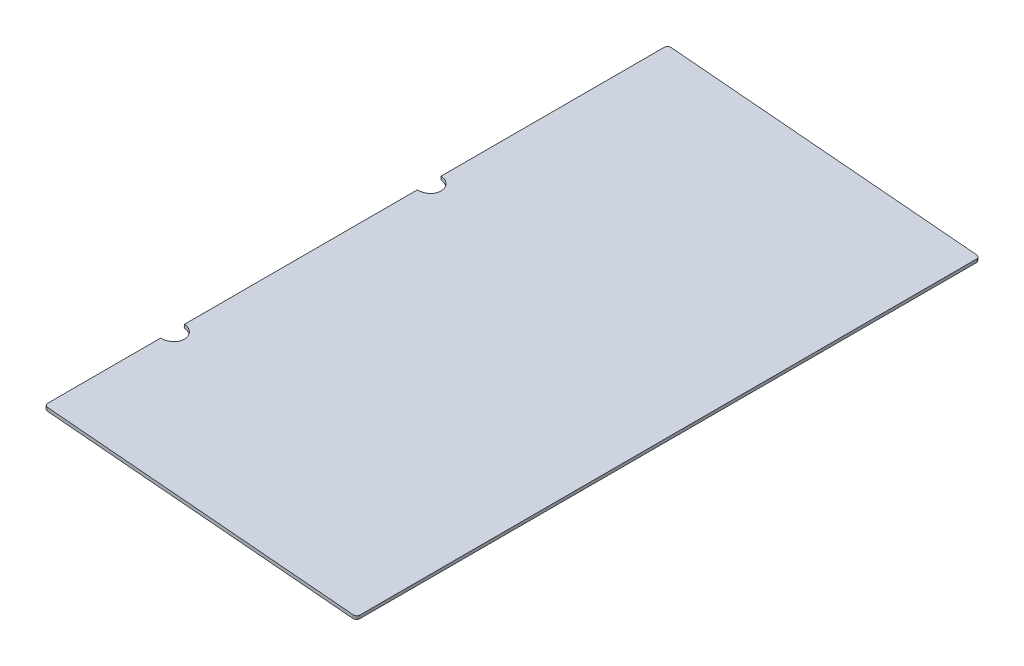
ISO-10303-21;
HEADER;
FILE_DESCRIPTION(('STEP AP214'),'2;1');
FILE_NAME('part.step','',(''),(''),'','','');
FILE_SCHEMA(('AUTOMOTIVE_DESIGN { 1 0 10303 214 1 1 1 1 }'));
ENDSEC;
DATA;
#1=APPLICATION_CONTEXT('core data for automotive mechanical design processes');
#2=APPLICATION_PROTOCOL_DEFINITION('international standard','automotive_design',2000,#1);
#3=PRODUCT_CONTEXT('',#1,'mechanical');
#4=PRODUCT('Part','Part','',(#3));
#5=PRODUCT_RELATED_PRODUCT_CATEGORY('part','',(#4));
#6=PRODUCT_DEFINITION_FORMATION('','',#4);
#7=PRODUCT_DEFINITION_CONTEXT('part definition',#1,'design');
#8=PRODUCT_DEFINITION('design','',#6,#7);
#9=PRODUCT_DEFINITION_SHAPE('','',#8);
#10=(LENGTH_UNIT() NAMED_UNIT(*) SI_UNIT(.MILLI.,.METRE.));
#11=(NAMED_UNIT(*) PLANE_ANGLE_UNIT() SI_UNIT($,.RADIAN.));
#12=(NAMED_UNIT(*) SI_UNIT($,.STERADIAN.) SOLID_ANGLE_UNIT());
#13=UNCERTAINTY_MEASURE_WITH_UNIT(LENGTH_MEASURE(1.E-05),#10,'distance_accuracy_value','');
#14=(GEOMETRIC_REPRESENTATION_CONTEXT(3) GLOBAL_UNCERTAINTY_ASSIGNED_CONTEXT((#13)) GLOBAL_UNIT_ASSIGNED_CONTEXT((#10,
#11,#12)) REPRESENTATION_CONTEXT('',''));
#15=CARTESIAN_POINT('',(0.,0.,0.));
#16=DIRECTION('',(0.,0.,1.));
#17=DIRECTION('',(1.,0.,0.));
#18=AXIS2_PLACEMENT_3D('',#15,#16,#17);
#19=CARTESIAN_POINT('',(22.7784389664476,57.5191558323467,1168.4));
#20=DIRECTION('',(0.996194698091745,-0.0871557427476619,0.));
#21=DIRECTION('',(0.0871557427476619,0.996194698091745,0.));
#22=AXIS2_PLACEMENT_3D('',#19,#20,#21);
#23=PLANE('',#22);
#24=DIRECTION('',(0.,0.,-1.));
#25=VECTOR('',#24,1.);
#26=CARTESIAN_POINT('',(22.7784389664476,57.5191558323467,1168.4));
#27=LINE('',#26,#25);
#28=CARTESIAN_POINT('',(22.7784389664476,57.5191558323467,424.65625));
#29=VERTEX_POINT('',#28);
#30=CARTESIAN_POINT('',(22.7784389664476,57.5191558323467,6.35000000000008));
#31=VERTEX_POINT('',#30);
#32=EDGE_CURVE('E156',#29,#31,#27,.T.);
#33=ORIENTED_EDGE('',*,*,#32,.T.);
#34=DIRECTION('',(-0.0871557427476619,-0.996194698091745,0.));
#35=VECTOR('',#34,1.);
#36=CARTESIAN_POINT('',(22.7784389664476,57.5191558323467,6.35000000000008));
#37=LINE('',#36,#35);
#38=CARTESIAN_POINT('',(22.225,51.1933194994641,6.35000000000008));
#39=VERTEX_POINT('',#38);
#40=EDGE_CURVE('E11',#31,#39,#37,.T.);
#41=ORIENTED_EDGE('',*,*,#40,.T.);
#42=DIRECTION('',(0.,0.,-1.));
#43=VECTOR('',#42,1.);
#44=CARTESIAN_POINT('',(22.225,51.1933194994641,1168.4));
#45=LINE('',#44,#43);
#46=CARTESIAN_POINT('',(22.225,51.1933194994641,424.65625));
#47=VERTEX_POINT('',#46);
#48=EDGE_CURVE('E170',#47,#39,#45,.T.);
#49=ORIENTED_EDGE('',*,*,#48,.F.);
#50=DIRECTION('',(0.0871557427476614,0.996194698091745,0.));
#51=VECTOR('',#50,1.);
#52=CARTESIAN_POINT('',(17.7801866800984,0.388870776980426,424.65625));
#53=LINE('',#52,#51);
#54=EDGE_CURVE('E225',#47,#29,#53,.T.);
#55=ORIENTED_EDGE('',*,*,#54,.T.);
#56=EDGE_LOOP('',(#33,#41,#49,#55));
#57=FACE_BOUND('',#56,.T.);
#58=ADVANCED_FACE('F38',(#57),#23,.F.);
#59=CARTESIAN_POINT('',(22.7784389664476,57.5191558323467,905.66875));
#60=VERTEX_POINT('',#59);
#61=CARTESIAN_POINT('',(22.7784389664476,57.5191558323467,469.10625));
#62=VERTEX_POINT('',#61);
#63=EDGE_CURVE('E146',#60,#62,#27,.T.);
#64=ORIENTED_EDGE('',*,*,#63,.T.);
#65=DIRECTION('',(0.0871557427476614,0.996194698091745,0.));
#66=VECTOR('',#65,1.);
#67=CARTESIAN_POINT('',(17.7801866800984,0.388870776980426,469.10625));
#68=LINE('',#67,#66);
#69=CARTESIAN_POINT('',(22.225,51.1933194994641,469.10625));
#70=VERTEX_POINT('',#69);
#71=EDGE_CURVE('E223',#62,#70,#68,.F.);
#72=ORIENTED_EDGE('',*,*,#71,.T.);
#73=CARTESIAN_POINT('',(22.225,51.1933194994641,905.66875));
#74=VERTEX_POINT('',#73);
#75=EDGE_CURVE('E148',#74,#70,#45,.T.);
#76=ORIENTED_EDGE('',*,*,#75,.F.);
#77=DIRECTION('',(0.0871557427476614,0.996194698091745,0.));
#78=VECTOR('',#77,1.);
#79=CARTESIAN_POINT('',(17.7801866800984,0.388870776980422,905.66875));
#80=LINE('',#79,#78);
#81=EDGE_CURVE('E132',#74,#60,#80,.T.);
#82=ORIENTED_EDGE('',*,*,#81,.T.);
#83=EDGE_LOOP('',(#64,#72,#76,#82));
#84=FACE_BOUND('',#83,.T.);
#85=ADVANCED_FACE('F144',(#84),#23,.F.);
#86=CARTESIAN_POINT('',(22.225,51.1933194994641,1162.05));
#87=VERTEX_POINT('',#86);
#88=CARTESIAN_POINT('',(22.225,51.1933194994641,950.11875));
#89=VERTEX_POINT('',#88);
#90=EDGE_CURVE('E171',#87,#89,#45,.T.);
#91=ORIENTED_EDGE('',*,*,#90,.F.);
#92=DIRECTION('',(-0.0871557427476619,-0.996194698091745,0.));
#93=VECTOR('',#92,1.);
#94=CARTESIAN_POINT('',(22.7784389664476,57.5191558323467,1162.05));
#95=LINE('',#94,#93);
#96=CARTESIAN_POINT('',(22.7784389664476,57.5191558323467,1162.05));
#97=VERTEX_POINT('',#96);
#98=EDGE_CURVE('E199',#87,#97,#95,.F.);
#99=ORIENTED_EDGE('',*,*,#98,.T.);
#100=CARTESIAN_POINT('',(22.7784389664476,57.5191558323467,950.11875));
#101=VERTEX_POINT('',#100);
#102=EDGE_CURVE('E155',#97,#101,#27,.T.);
#103=ORIENTED_EDGE('',*,*,#102,.T.);
#104=DIRECTION('',(0.0871557427476614,0.996194698091745,0.));
#105=VECTOR('',#104,1.);
#106=CARTESIAN_POINT('',(17.7801866800984,0.388870776980422,950.11875));
#107=LINE('',#106,#105);
#108=EDGE_CURVE('E135',#101,#89,#107,.F.);
#109=ORIENTED_EDGE('',*,*,#108,.T.);
#110=EDGE_LOOP('',(#91,#99,#103,#109));
#111=FACE_BOUND('',#110,.T.);
#112=ADVANCED_FACE('F250',(#111),#23,.F.);
#113=CARTESIAN_POINT('',(22.225,51.1933194994641,1168.4));
#114=DIRECTION('',(0.0871557427476615,0.996194698091745,0.));
#115=DIRECTION('',(-0.996194698091745,0.0871557427476615,0.));
#116=AXIS2_PLACEMENT_3D('',#113,#114,#115);
#117=PLANE('',#116);
#118=DIRECTION('',(0.,0.,-1.));
#119=VECTOR('',#118,1.);
#120=CARTESIAN_POINT('',(607.367319430825,0.,1168.4));
#121=LINE('',#120,#119);
#122=CARTESIAN_POINT('',(607.367319430825,0.,1162.05));
#123=VERTEX_POINT('',#122);
#124=CARTESIAN_POINT('',(607.367319430825,0.,6.35000000000008));
#125=VERTEX_POINT('',#124);
#126=EDGE_CURVE('E167',#123,#125,#121,.T.);
#127=ORIENTED_EDGE('',*,*,#126,.F.);
#128=CARTESIAN_POINT('',(601.041483097942,0.553438966447647,1162.05));
#129=DIRECTION('',(0.0871557427476615,0.996194698091745,0.));
#130=DIRECTION('',(-0.996194698091745,0.0871557427476615,0.));
#131=AXIS2_PLACEMENT_3D('',#128,#129,#130);
#132=CIRCLE('',#131,6.35);
#133=CARTESIAN_POINT('',(601.041483097942,0.553438966447634,1168.4));
#134=VERTEX_POINT('',#133);
#135=EDGE_CURVE('E197',#123,#134,#132,.F.);
#136=ORIENTED_EDGE('',*,*,#135,.T.);
#137=DIRECTION('',(0.996194698091745,-0.0871557427476615,0.));
#138=VECTOR('',#137,1.);
#139=CARTESIAN_POINT('',(22.225,51.1933194994641,1168.4));
#140=LINE('',#139,#138);
#141=CARTESIAN_POINT('',(28.5508363328826,50.6398805330165,1168.4));
#142=VERTEX_POINT('',#141);
#143=EDGE_CURVE('E208',#142,#134,#140,.T.);
#144=ORIENTED_EDGE('',*,*,#143,.F.);
#145=CARTESIAN_POINT('',(28.5508363328826,50.6398805330165,1162.05));
#146=DIRECTION('',(0.0871557427476615,0.996194698091745,0.));
#147=DIRECTION('',(-0.996194698091745,0.0871557427476615,0.));
#148=AXIS2_PLACEMENT_3D('',#145,#146,#147);
#149=CIRCLE('',#148,6.35);
#150=EDGE_CURVE('E53',#142,#87,#149,.F.);
#151=ORIENTED_EDGE('',*,*,#150,.T.);
#152=ORIENTED_EDGE('',*,*,#90,.T.);
#153=CARTESIAN_POINT('',(22.225,51.1933194994641,927.89375));
#154=DIRECTION('',(0.0871557427476615,0.996194698091745,0.));
#155=DIRECTION('',(-0.996194698091745,0.0871557427476615,0.));
#156=AXIS2_PLACEMENT_3D('',#153,#154,#155);
#157=CIRCLE('',#156,22.225);
#158=EDGE_CURVE('E217',#89,#74,#157,.T.);
#159=ORIENTED_EDGE('',*,*,#158,.T.);
#160=ORIENTED_EDGE('',*,*,#75,.T.);
#161=CARTESIAN_POINT('',(22.225,51.1933194994641,446.88125));
#162=DIRECTION('',(0.0871557427476615,0.996194698091745,0.));
#163=DIRECTION('',(-0.996194698091745,0.0871557427476615,0.));
#164=AXIS2_PLACEMENT_3D('',#161,#162,#163);
#165=CIRCLE('',#164,22.225);
#166=EDGE_CURVE('E149',#70,#47,#165,.T.);
#167=ORIENTED_EDGE('',*,*,#166,.T.);
#168=ORIENTED_EDGE('',*,*,#48,.T.);
#169=CARTESIAN_POINT('',(28.5508363328826,50.6398805330165,6.35000000000008));
#170=DIRECTION('',(0.0871557427476615,0.996194698091745,0.));
#171=DIRECTION('',(-0.996194698091745,0.0871557427476615,0.));
#172=AXIS2_PLACEMENT_3D('',#169,#170,#171);
#173=CIRCLE('',#172,6.35);
#174=CARTESIAN_POINT('',(28.5508363328826,50.6398805330165,0.));
#175=VERTEX_POINT('',#174);
#176=EDGE_CURVE('E192',#39,#175,#173,.F.);
#177=ORIENTED_EDGE('',*,*,#176,.T.);
#178=DIRECTION('',(0.996194698091745,-0.0871557427476615,0.));
#179=VECTOR('',#178,1.);
#180=CARTESIAN_POINT('',(22.225,51.1933194994641,0.));
#181=LINE('',#180,#179);
#182=CARTESIAN_POINT('',(601.041483097942,0.553438966447654,0.));
#183=VERTEX_POINT('',#182);
#184=EDGE_CURVE('E205',#175,#183,#181,.T.);
#185=ORIENTED_EDGE('',*,*,#184,.T.);
#186=CARTESIAN_POINT('',(601.041483097942,0.553438966447657,6.35000000000008));
#187=DIRECTION('',(0.0871557427476615,0.996194698091745,0.));
#188=DIRECTION('',(-0.996194698091745,0.0871557427476615,0.));
#189=AXIS2_PLACEMENT_3D('',#186,#187,#188);
#190=CIRCLE('',#189,6.35);
#191=EDGE_CURVE('E194',#183,#125,#190,.F.);
#192=ORIENTED_EDGE('',*,*,#191,.T.);
#193=EDGE_LOOP('',(#127,#136,#144,#151,#152,#159,#160,#167,#168,#177,#185,#192));
#194=FACE_BOUND('',#193,.T.);
#195=ADVANCED_FACE('F216',(#194),#117,.F.);
#196=CARTESIAN_POINT('',(607.367319430825,0.,1168.4));
#197=DIRECTION('',(-0.996194698091754,0.087155742747558,0.));
#198=DIRECTION('',(-0.087155742747558,-0.996194698091754,0.));
#199=AXIS2_PLACEMENT_3D('',#196,#197,#198);
#200=PLANE('',#199);
#201=DIRECTION('',(0.,0.,-1.));
#202=VECTOR('',#201,1.);
#203=CARTESIAN_POINT('',(607.920758397272,6.32583633288266,1168.4));
#204=LINE('',#203,#202);
#205=CARTESIAN_POINT('',(607.920758397272,6.32583633288266,1162.05));
#206=VERTEX_POINT('',#205);
#207=CARTESIAN_POINT('',(607.920758397272,6.32583633288266,6.35000000000008));
#208=VERTEX_POINT('',#207);
#209=EDGE_CURVE('E158',#206,#208,#204,.T.);
#210=ORIENTED_EDGE('',*,*,#209,.F.);
#211=DIRECTION('',(0.087155742747558,0.996194698091754,0.));
#212=VECTOR('',#211,1.);
#213=CARTESIAN_POINT('',(607.367319430825,0.,1162.05));
#214=LINE('',#213,#212);
#215=EDGE_CURVE('E190',#206,#123,#214,.F.);
#216=ORIENTED_EDGE('',*,*,#215,.T.);
#217=ORIENTED_EDGE('',*,*,#126,.T.);
#218=DIRECTION('',(0.087155742747558,0.996194698091754,0.));
#219=VECTOR('',#218,1.);
#220=CARTESIAN_POINT('',(607.367319430825,0.,6.35000000000008));
#221=LINE('',#220,#219);
#222=EDGE_CURVE('E187',#125,#208,#221,.T.);
#223=ORIENTED_EDGE('',*,*,#222,.T.);
#224=EDGE_LOOP('',(#210,#216,#217,#223));
#225=FACE_BOUND('',#224,.T.);
#226=ADVANCED_FACE('F236',(#225),#200,.F.);
#227=CARTESIAN_POINT('',(607.920758397272,6.32583633288266,1168.4));
#228=DIRECTION('',(-0.0871557427476614,-0.996194698091745,0.));
#229=DIRECTION('',(0.996194698091745,-0.0871557427476614,0.));
#230=AXIS2_PLACEMENT_3D('',#227,#228,#229);
#231=PLANE('',#230);
#232=DIRECTION('',(-0.996194698091745,0.0871557427476614,0.));
#233=VECTOR('',#232,1.);
#234=CARTESIAN_POINT('',(607.920758397272,6.32583633288266,1168.4));
#235=LINE('',#234,#233);
#236=CARTESIAN_POINT('',(601.594922064389,6.87927529933029,1168.4));
#237=VERTEX_POINT('',#236);
#238=CARTESIAN_POINT('',(29.1042752993302,56.965716865899,1168.4));
#239=VERTEX_POINT('',#238);
#240=EDGE_CURVE('E160',#237,#239,#235,.T.);
#241=ORIENTED_EDGE('',*,*,#240,.F.);
#242=CARTESIAN_POINT('',(601.594922064389,6.8792752993303,1162.05));
#243=DIRECTION('',(-0.0871557427476614,-0.996194698091745,0.));
#244=DIRECTION('',(0.996194698091745,-0.0871557427476614,0.));
#245=AXIS2_PLACEMENT_3D('',#242,#243,#244);
#246=CIRCLE('',#245,6.35);
#247=EDGE_CURVE('E185',#237,#206,#246,.F.);
#248=ORIENTED_EDGE('',*,*,#247,.T.);
#249=ORIENTED_EDGE('',*,*,#209,.T.);
#250=CARTESIAN_POINT('',(601.594922064389,6.87927529933031,6.35000000000008));
#251=DIRECTION('',(-0.0871557427476614,-0.996194698091745,0.));
#252=DIRECTION('',(0.996194698091745,-0.0871557427476614,0.));
#253=AXIS2_PLACEMENT_3D('',#250,#251,#252);
#254=CIRCLE('',#253,6.35);
#255=CARTESIAN_POINT('',(601.594922064389,6.8792752993303,0.));
#256=VERTEX_POINT('',#255);
#257=EDGE_CURVE('E181',#208,#256,#254,.F.);
#258=ORIENTED_EDGE('',*,*,#257,.T.);
#259=DIRECTION('',(-0.996194698091745,0.0871557427476614,0.));
#260=VECTOR('',#259,1.);
#261=CARTESIAN_POINT('',(607.920758397272,6.32583633288266,0.));
#262=LINE('',#261,#260);
#263=CARTESIAN_POINT('',(29.1042752993302,56.965716865899,0.));
#264=VERTEX_POINT('',#263);
#265=EDGE_CURVE('E163',#256,#264,#262,.T.);
#266=ORIENTED_EDGE('',*,*,#265,.T.);
#267=CARTESIAN_POINT('',(29.1042752993302,56.965716865899,6.35000000000008));
#268=DIRECTION('',(-0.0871557427476614,-0.996194698091745,0.));
#269=DIRECTION('',(0.996194698091745,-0.0871557427476614,0.));
#270=AXIS2_PLACEMENT_3D('',#267,#268,#269);
#271=CIRCLE('',#270,6.35);
#272=EDGE_CURVE('E179',#264,#31,#271,.F.);
#273=ORIENTED_EDGE('',*,*,#272,.T.);
#274=ORIENTED_EDGE('',*,*,#32,.F.);
#275=CARTESIAN_POINT('',(22.7784389664476,57.5191558323467,446.88125));
#276=DIRECTION('',(0.0871557427476614,0.996194698091745,0.));
#277=DIRECTION('',(-0.996194698091745,0.0871557427476614,0.));
#278=AXIS2_PLACEMENT_3D('',#275,#276,#277);
#279=CIRCLE('',#278,22.225);
#280=EDGE_CURVE('E139',#62,#29,#279,.T.);
#281=ORIENTED_EDGE('',*,*,#280,.F.);
#282=ORIENTED_EDGE('',*,*,#63,.F.);
#283=CARTESIAN_POINT('',(22.7784389664477,57.5191558323467,927.89375));
#284=DIRECTION('',(0.0871557427476614,0.996194698091745,0.));
#285=DIRECTION('',(-0.996194698091745,0.0871557427476614,0.));
#286=AXIS2_PLACEMENT_3D('',#283,#284,#285);
#287=CIRCLE('',#286,22.225);
#288=EDGE_CURVE('E128',#101,#60,#287,.T.);
#289=ORIENTED_EDGE('',*,*,#288,.F.);
#290=ORIENTED_EDGE('',*,*,#102,.F.);
#291=CARTESIAN_POINT('',(29.1042752993302,56.965716865899,1162.05));
#292=DIRECTION('',(-0.0871557427476614,-0.996194698091745,0.));
#293=DIRECTION('',(0.996194698091745,-0.0871557427476614,0.));
#294=AXIS2_PLACEMENT_3D('',#291,#292,#293);
#295=CIRCLE('',#294,6.35);
#296=EDGE_CURVE('E183',#97,#239,#295,.F.);
#297=ORIENTED_EDGE('',*,*,#296,.T.);
#298=EDGE_LOOP('',(#241,#248,#249,#258,#266,#273,#274,#281,#282,#289,#290,#297));
#299=FACE_BOUND('',#298,.T.);
#300=ADVANCED_FACE('F153',(#299),#231,.F.);
#301=CARTESIAN_POINT('',(0.,0.,1168.4));
#302=DIRECTION('',(0.,0.,1.));
#303=DIRECTION('',(1.,0.,0.));
#304=AXIS2_PLACEMENT_3D('',#301,#302,#303);
#305=PLANE('',#304);
#306=ORIENTED_EDGE('',*,*,#143,.T.);
#307=DIRECTION('',(0.087155742747558,0.996194698091754,0.));
#308=VECTOR('',#307,1.);
#309=CARTESIAN_POINT('',(601.594922064389,6.87927529932965,1168.4));
#310=LINE('',#309,#308);
#311=EDGE_CURVE('E176',#134,#237,#310,.T.);
#312=ORIENTED_EDGE('',*,*,#311,.T.);
#313=ORIENTED_EDGE('',*,*,#240,.T.);
#314=DIRECTION('',(-0.0871557427476619,-0.996194698091745,0.));
#315=VECTOR('',#314,1.);
#316=CARTESIAN_POINT('',(28.5508363328826,50.6398805330165,1168.4));
#317=LINE('',#316,#315);
#318=EDGE_CURVE('E173',#239,#142,#317,.T.);
#319=ORIENTED_EDGE('',*,*,#318,.T.);
#320=EDGE_LOOP('',(#306,#312,#313,#319));
#321=FACE_BOUND('',#320,.T.);
#322=ADVANCED_FACE('F243',(#321),#305,.T.);
#323=CARTESIAN_POINT('',(0.,0.,0.));
#324=DIRECTION('',(0.,0.,1.));
#325=DIRECTION('',(1.,0.,0.));
#326=AXIS2_PLACEMENT_3D('',#323,#324,#325);
#327=PLANE('',#326);
#328=ORIENTED_EDGE('',*,*,#265,.F.);
#329=DIRECTION('',(0.087155742747558,0.996194698091754,0.));
#330=VECTOR('',#329,1.);
#331=CARTESIAN_POINT('',(596.4278459334,-52.1806751302984,0.));
#332=LINE('',#331,#330);
#333=EDGE_CURVE('E46',#256,#183,#332,.F.);
#334=ORIENTED_EDGE('',*,*,#333,.T.);
#335=ORIENTED_EDGE('',*,*,#184,.F.);
#336=DIRECTION('',(-0.0871557427476619,-0.996194698091745,0.));
#337=VECTOR('',#336,1.);
#338=CARTESIAN_POINT('',(23.9371991683291,-2.09423356379106,0.));
#339=LINE('',#338,#337);
#340=EDGE_CURVE('E201',#175,#264,#339,.F.);
#341=ORIENTED_EDGE('',*,*,#340,.T.);
#342=EDGE_LOOP('',(#328,#334,#335,#341));
#343=FACE_BOUND('',#342,.T.);
#344=ADVANCED_FACE('F204',(#343),#327,.F.);
#345=CARTESIAN_POINT('',(17.7801866800984,0.388870776980417,927.89375));
#346=DIRECTION('',(0.0871557427476614,0.996194698091745,0.));
#347=DIRECTION('',(-0.996194698091745,0.0871557427476614,0.));
#348=AXIS2_PLACEMENT_3D('',#345,#346,#347);
#349=CYLINDRICAL_SURFACE('',#348,22.225);
#350=ORIENTED_EDGE('',*,*,#158,.F.);
#351=ORIENTED_EDGE('',*,*,#108,.F.);
#352=ORIENTED_EDGE('',*,*,#288,.T.);
#353=ORIENTED_EDGE('',*,*,#81,.F.);
#354=EDGE_LOOP('',(#350,#351,#352,#353));
#355=FACE_BOUND('',#354,.T.);
#356=ADVANCED_FACE('F131',(#355),#349,.F.);
#357=CARTESIAN_POINT('',(17.7801866800984,0.388870776980424,446.88125));
#358=DIRECTION('',(0.0871557427476614,0.996194698091745,0.));
#359=DIRECTION('',(-0.996194698091745,0.0871557427476614,0.));
#360=AXIS2_PLACEMENT_3D('',#357,#358,#359);
#361=CYLINDRICAL_SURFACE('',#360,22.225);
#362=ORIENTED_EDGE('',*,*,#166,.F.);
#363=ORIENTED_EDGE('',*,*,#71,.F.);
#364=ORIENTED_EDGE('',*,*,#280,.T.);
#365=ORIENTED_EDGE('',*,*,#54,.F.);
#366=EDGE_LOOP('',(#362,#363,#364,#365));
#367=FACE_BOUND('',#366,.T.);
#368=ADVANCED_FACE('F276',(#367),#361,.F.);
#369=CARTESIAN_POINT('',(596.4278459334,-52.1806751302984,1162.05));
#370=DIRECTION('',(-0.087155742747558,-0.996194698091754,0.));
#371=DIRECTION('',(0.996194698091754,-0.087155742747558,0.));
#372=AXIS2_PLACEMENT_3D('',#369,#370,#371);
#373=CYLINDRICAL_SURFACE('',#372,6.35);
#374=ORIENTED_EDGE('',*,*,#135,.F.);
#375=ORIENTED_EDGE('',*,*,#215,.F.);
#376=ORIENTED_EDGE('',*,*,#247,.F.);
#377=ORIENTED_EDGE('',*,*,#311,.F.);
#378=EDGE_LOOP('',(#374,#375,#376,#377));
#379=FACE_BOUND('',#378,.T.);
#380=ADVANCED_FACE('F241',(#379),#373,.T.);
#381=CARTESIAN_POINT('',(23.9371991683291,-2.09423356379106,1162.05));
#382=DIRECTION('',(0.0871557427476619,0.996194698091745,0.));
#383=DIRECTION('',(-0.996194698091745,0.0871557427476619,0.));
#384=AXIS2_PLACEMENT_3D('',#381,#382,#383);
#385=CYLINDRICAL_SURFACE('',#384,6.35);
#386=ORIENTED_EDGE('',*,*,#296,.F.);
#387=ORIENTED_EDGE('',*,*,#98,.F.);
#388=ORIENTED_EDGE('',*,*,#150,.F.);
#389=ORIENTED_EDGE('',*,*,#318,.F.);
#390=EDGE_LOOP('',(#386,#387,#388,#389));
#391=FACE_BOUND('',#390,.T.);
#392=ADVANCED_FACE('F247',(#391),#385,.T.);
#393=CARTESIAN_POINT('',(601.041483097942,0.553438966446986,6.35000000000008));
#394=DIRECTION('',(0.087155742747558,0.996194698091754,0.));
#395=DIRECTION('',(-0.996194698091754,0.087155742747558,0.));
#396=AXIS2_PLACEMENT_3D('',#393,#394,#395);
#397=CYLINDRICAL_SURFACE('',#396,6.35);
#398=ORIENTED_EDGE('',*,*,#191,.F.);
#399=ORIENTED_EDGE('',*,*,#333,.F.);
#400=ORIENTED_EDGE('',*,*,#257,.F.);
#401=ORIENTED_EDGE('',*,*,#222,.F.);
#402=EDGE_LOOP('',(#398,#399,#400,#401));
#403=FACE_BOUND('',#402,.T.);
#404=ADVANCED_FACE('F233',(#403),#397,.T.);
#405=CARTESIAN_POINT('',(29.1042752993302,56.965716865899,6.35000000000008));
#406=DIRECTION('',(-0.0871557427476619,-0.996194698091745,0.));
#407=DIRECTION('',(0.996194698091745,-0.0871557427476619,0.));
#408=AXIS2_PLACEMENT_3D('',#405,#406,#407);
#409=CYLINDRICAL_SURFACE('',#408,6.35);
#410=ORIENTED_EDGE('',*,*,#272,.F.);
#411=ORIENTED_EDGE('',*,*,#340,.F.);
#412=ORIENTED_EDGE('',*,*,#176,.F.);
#413=ORIENTED_EDGE('',*,*,#40,.F.);
#414=EDGE_LOOP('',(#410,#411,#412,#413));
#415=FACE_BOUND('',#414,.T.);
#416=ADVANCED_FACE('F40',(#415),#409,.T.);
#417=CLOSED_SHELL('',(#58,#85,#112,#195,#226,#300,#322,#344,#356,#368,#380,#392,#404,#416));
#418=MANIFOLD_SOLID_BREP('B2',#417);
#419=ADVANCED_BREP_SHAPE_REPRESENTATION('',(#18,#418),#14);
#420=SHAPE_DEFINITION_REPRESENTATION(#9,#419);
ENDSEC;
END-ISO-10303-21;
